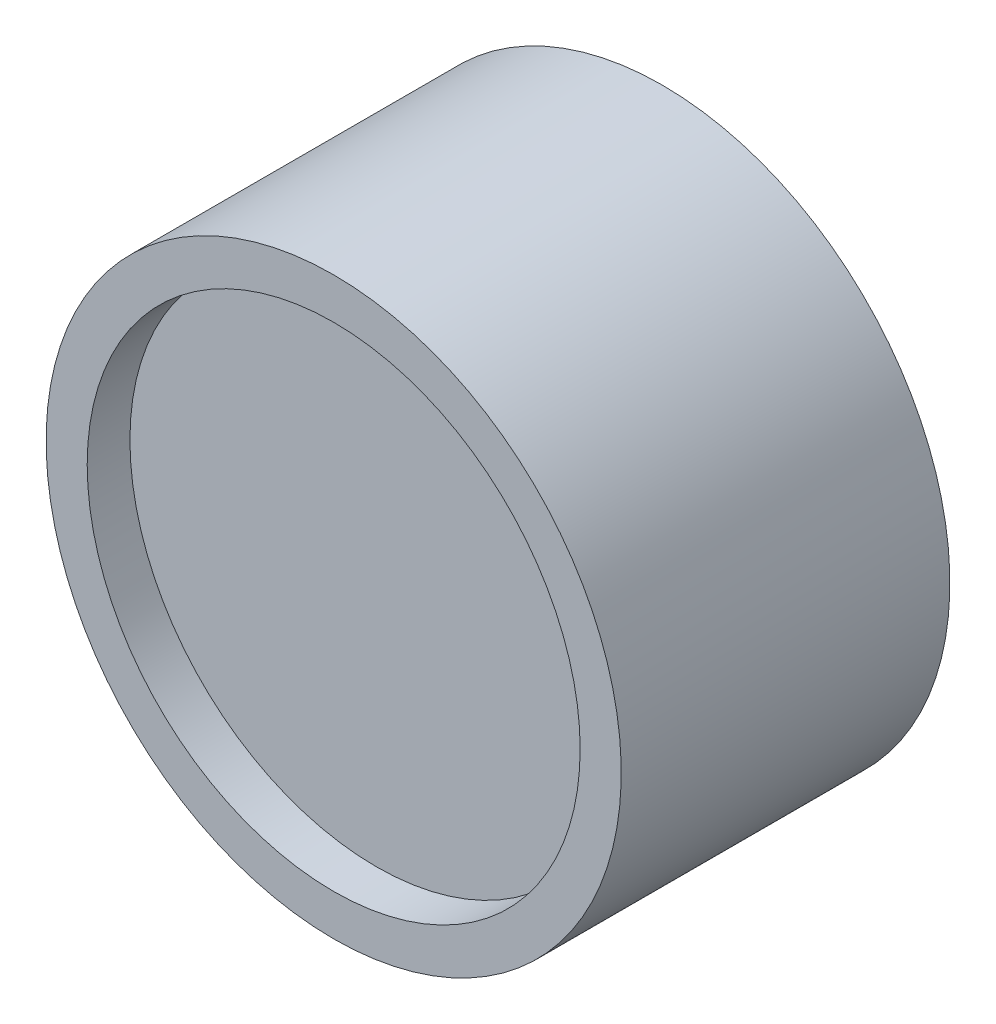
ISO-10303-21;
HEADER;
FILE_DESCRIPTION(('STEP AP214'),'2;1');
FILE_NAME('part.step','',(''),(''),'','','');
FILE_SCHEMA(('AUTOMOTIVE_DESIGN { 1 0 10303 214 1 1 1 1 }'));
ENDSEC;
DATA;
#1=APPLICATION_CONTEXT('core data for automotive mechanical design processes');
#2=APPLICATION_PROTOCOL_DEFINITION('international standard','automotive_design',2000,#1);
#3=PRODUCT_CONTEXT('',#1,'mechanical');
#4=PRODUCT('Part','Part','',(#3));
#5=PRODUCT_RELATED_PRODUCT_CATEGORY('part','',(#4));
#6=PRODUCT_DEFINITION_FORMATION('','',#4);
#7=PRODUCT_DEFINITION_CONTEXT('part definition',#1,'design');
#8=PRODUCT_DEFINITION('design','',#6,#7);
#9=PRODUCT_DEFINITION_SHAPE('','',#8);
#10=(LENGTH_UNIT() NAMED_UNIT(*) SI_UNIT(.MILLI.,.METRE.));
#11=(NAMED_UNIT(*) PLANE_ANGLE_UNIT() SI_UNIT($,.RADIAN.));
#12=(NAMED_UNIT(*) SI_UNIT($,.STERADIAN.) SOLID_ANGLE_UNIT());
#13=UNCERTAINTY_MEASURE_WITH_UNIT(LENGTH_MEASURE(1.E-05),#10,'distance_accuracy_value','');
#14=(GEOMETRIC_REPRESENTATION_CONTEXT(3) GLOBAL_UNCERTAINTY_ASSIGNED_CONTEXT((#13)) GLOBAL_UNIT_ASSIGNED_CONTEXT((#10,
#11,#12)) REPRESENTATION_CONTEXT('',''));
#15=CARTESIAN_POINT('',(0.,0.,0.));
#16=DIRECTION('',(0.,0.,1.));
#17=DIRECTION('',(1.,0.,0.));
#18=AXIS2_PLACEMENT_3D('',#15,#16,#17);
#19=CARTESIAN_POINT('',(0.,19.05,-9.39799999999999));
#20=DIRECTION('',(0.,0.,-1.));
#21=DIRECTION('',(0.,1.,0.));
#22=AXIS2_PLACEMENT_3D('',#19,#20,#21);
#23=PLANE('',#22);
#24=CARTESIAN_POINT('',(0.,0.,-9.39799999999999));
#25=DIRECTION('',(0.,0.,-1.));
#26=DIRECTION('',(0.,1.,0.));
#27=AXIS2_PLACEMENT_3D('',#24,#25,#26);
#28=CIRCLE('',#27,19.05);
#29=CARTESIAN_POINT('',(0.,19.05,-9.39799999999999));
#30=VERTEX_POINT('',#29);
#31=EDGE_CURVE('E68',#30,#30,#28,.T.);
#32=ORIENTED_EDGE('',*,*,#31,.T.);
#33=EDGE_LOOP('',(#32));
#34=FACE_BOUND('',#33,.T.);
#35=ADVANCED_FACE('F42',(#34),#23,.T.);
#36=CARTESIAN_POINT('',(0.,0.,9.39799999999999));
#37=DIRECTION('',(0.,0.,1.));
#38=DIRECTION('',(0.,-1.,0.));
#39=AXIS2_PLACEMENT_3D('',#36,#37,#38);
#40=PLANE('',#39);
#41=CARTESIAN_POINT('',(0.,0.,9.39799999999999));
#42=DIRECTION('',(0.,0.,-1.));
#43=DIRECTION('',(0.,1.,0.));
#44=AXIS2_PLACEMENT_3D('',#41,#42,#43);
#45=CIRCLE('',#44,19.05);
#46=CARTESIAN_POINT('',(0.,19.05,9.39799999999999));
#47=VERTEX_POINT('',#46);
#48=EDGE_CURVE('E54',#47,#47,#45,.T.);
#49=ORIENTED_EDGE('',*,*,#48,.F.);
#50=EDGE_LOOP('',(#49));
#51=FACE_BOUND('',#50,.T.);
#52=ADVANCED_FACE('F98',(#51),#40,.T.);
#53=CARTESIAN_POINT('',(0.,0.,0.));
#54=DIRECTION('',(0.,0.,-1.));
#55=DIRECTION('',(0.,1.,0.));
#56=AXIS2_PLACEMENT_3D('',#53,#54,#55);
#57=CYLINDRICAL_SURFACE('',#56,19.05);
#58=ORIENTED_EDGE('',*,*,#48,.T.);
#59=EDGE_LOOP('',(#58));
#60=FACE_BOUND('',#59,.T.);
#61=CARTESIAN_POINT('',(0.,0.,12.7));
#62=DIRECTION('',(0.,0.,-1.));
#63=DIRECTION('',(0.,1.,0.));
#64=AXIS2_PLACEMENT_3D('',#61,#62,#63);
#65=CIRCLE('',#64,19.05);
#66=CARTESIAN_POINT('',(0.,19.05,12.7));
#67=VERTEX_POINT('',#66);
#68=EDGE_CURVE('E87',#67,#67,#65,.T.);
#69=ORIENTED_EDGE('',*,*,#68,.F.);
#70=EDGE_LOOP('',(#69));
#71=FACE_BOUND('',#70,.T.);
#72=ADVANCED_FACE('F95',(#60,#71),#57,.F.);
#73=CARTESIAN_POINT('',(0.,19.05,12.7));
#74=DIRECTION('',(0.,0.,1.));
#75=DIRECTION('',(0.,-1.,0.));
#76=AXIS2_PLACEMENT_3D('',#73,#74,#75);
#77=PLANE('',#76);
#78=ORIENTED_EDGE('',*,*,#68,.T.);
#79=EDGE_LOOP('',(#78));
#80=FACE_BOUND('',#79,.T.);
#81=CARTESIAN_POINT('',(0.,0.,12.7));
#82=DIRECTION('',(0.,0.,-1.));
#83=DIRECTION('',(0.,1.,0.));
#84=AXIS2_PLACEMENT_3D('',#81,#82,#83);
#85=CIRCLE('',#84,22.225);
#86=CARTESIAN_POINT('',(0.,22.225,12.7));
#87=VERTEX_POINT('',#86);
#88=EDGE_CURVE('E83',#87,#87,#85,.T.);
#89=ORIENTED_EDGE('',*,*,#88,.F.);
#90=EDGE_LOOP('',(#89));
#91=FACE_BOUND('',#90,.T.);
#92=ADVANCED_FACE('F104',(#80,#91),#77,.T.);
#93=CARTESIAN_POINT('',(0.,0.,0.));
#94=DIRECTION('',(0.,0.,-1.));
#95=DIRECTION('',(0.,1.,0.));
#96=AXIS2_PLACEMENT_3D('',#93,#94,#95);
#97=CYLINDRICAL_SURFACE('',#96,22.225);
#98=CARTESIAN_POINT('',(0.,-22.225,-1.58749999999999));
#99=CARTESIAN_POINT('',(0.0890487798453091,-22.2249992505102,-1.58749609264574));
#100=CARTESIAN_POINT('',(0.178159230469294,-22.2244590967661,-1.57998219641666));
#101=CARTESIAN_POINT('',(0.35391763548917,-22.2223562476493,-1.5501167219226));
#102=CARTESIAN_POINT('',(0.440562633778052,-22.2207923746226,-1.52774805477268));
#103=CARTESIAN_POINT('',(0.608818958371993,-22.2168189279091,-1.46882052945944));
#104=CARTESIAN_POINT('',(0.690432988297742,-22.2144098131927,-1.43226937132088));
#105=CARTESIAN_POINT('',(0.846346733612157,-22.209016530152,-1.34602742457318));
#106=CARTESIAN_POINT('',(0.920648075413188,-22.2060324901352,-1.29633956679638));
#107=CARTESIAN_POINT('',(1.05998999170469,-22.1998181704503,-1.18513134139652));
#108=CARTESIAN_POINT('',(1.12501469630088,-22.1965874829863,-1.12359111017903));
#109=CARTESIAN_POINT('',(1.24382158914945,-22.1902474420535,-0.990466517408888));
#110=CARTESIAN_POINT('',(1.29760329834654,-22.1871380937593,-0.918881728082544));
#111=CARTESIAN_POINT('',(1.39244884206195,-22.1813881326419,-0.767607077207255));
#112=CARTESIAN_POINT('',(1.43349911461229,-22.1787480209346,-0.687908691951801));
#113=CARTESIAN_POINT('',(1.50162982074141,-22.1742396816116,-0.522728798321732));
#114=CARTESIAN_POINT('',(1.52871044238853,-22.1723714436044,-0.437247367819684));
#115=CARTESIAN_POINT('',(1.56808808720031,-22.1696215072539,-0.26308390438912));
#116=CARTESIAN_POINT('',(1.58041047843729,-22.1687381162285,-0.174407634237687));
#117=CARTESIAN_POINT('',(1.59000021081583,-22.1680524315257,0.00375869203487836));
#118=CARTESIAN_POINT('',(1.58726776650482,-22.1682501224418,0.093248736540714));
#119=CARTESIAN_POINT('',(1.56684640404739,-22.1697027374792,0.270329075308122));
#120=CARTESIAN_POINT('',(1.54918498269757,-22.1709557179102,0.357922558736066));
#121=CARTESIAN_POINT('',(1.49944968680589,-22.1743746638034,0.528898534779349));
#122=CARTESIAN_POINT('',(1.46737570439986,-22.1765406360985,0.612280995874039));
#123=CARTESIAN_POINT('',(1.38969470144194,-22.1815437306027,0.772556071415624));
#124=CARTESIAN_POINT('',(1.34407526138188,-22.1843814682512,0.849442646472426));
#125=CARTESIAN_POINT('',(1.24060729011334,-22.1904077269116,0.994477391924979));
#126=CARTESIAN_POINT('',(1.18275857799095,-22.1935962531125,1.06262543302315));
#127=CARTESIAN_POINT('',(1.05631956294509,-22.1999734282712,1.18840857781702));
#128=CARTESIAN_POINT('',(0.987705473474692,-22.2031620614841,1.24601977444662));
#129=CARTESIAN_POINT('',(0.841766632911346,-22.2091732949878,1.34890928276388));
#130=CARTESIAN_POINT('',(0.764441877818123,-22.2119958951105,1.39418758878778));
#131=CARTESIAN_POINT('',(0.603261759910861,-22.2169573533996,1.47112421961274));
#132=CARTESIAN_POINT('',(0.519405934472623,-22.2190961630752,1.50278157854456));
#133=CARTESIAN_POINT('',(0.347550767268368,-22.2224484329266,1.55156140764981));
#134=CARTESIAN_POINT('',(0.259551488702709,-22.2236619072117,1.56868409944569));
#135=CARTESIAN_POINT('',(0.0821147353008482,-22.225024960202,1.58787878281379));
#136=CARTESIAN_POINT('',(-0.00731914806021894,-22.2251768744895,1.58998381557813));
#137=CARTESIAN_POINT('',(-0.185268660784776,-22.2244059124829,1.57916984681902));
#138=CARTESIAN_POINT('',(-0.273784296409181,-22.2234830435218,1.5662509478017));
#139=CARTESIAN_POINT('',(-0.447291156480134,-22.2206678673679,1.52578320456595));
#140=CARTESIAN_POINT('',(-0.532285948667434,-22.2187765688341,1.49824958109011));
#141=CARTESIAN_POINT('',(-0.696448708516859,-22.2142371838267,1.42934945946167));
#142=CARTESIAN_POINT('',(-0.775616607956304,-22.211589088494,1.38798279937995));
#143=CARTESIAN_POINT('',(-0.926029235370737,-22.2058275571246,1.2925071647473));
#144=CARTESIAN_POINT('',(-0.997259969190544,-22.2027133211846,1.23837619275805));
#145=CARTESIAN_POINT('',(-1.12963525884953,-22.1963724429854,1.11894043615396));
#146=CARTESIAN_POINT('',(-1.19077968566527,-22.1931457992889,1.05363550862434));
#147=CARTESIAN_POINT('',(-1.30135918063973,-22.1869369396489,0.913562726582322));
#148=CARTESIAN_POINT('',(-1.35077276342895,-22.1839551786465,0.838777887660939));
#149=CARTESIAN_POINT('',(-1.43634079979411,-22.1785796677167,0.681953181825261));
#150=CARTESIAN_POINT('',(-1.47249535528283,-22.1761859132698,0.599913370680824));
#151=CARTESIAN_POINT('',(-1.530482072823,-22.1722596801863,0.430985059553188));
#152=CARTESIAN_POINT('',(-1.55232761141387,-22.1707263973451,0.344101170678658));
#153=CARTESIAN_POINT('',(-1.58111981510363,-22.1686918130773,0.167887330420388));
#154=CARTESIAN_POINT('',(-1.58806668223352,-22.1681904976567,0.0785574122222664));
#155=CARTESIAN_POINT('',(-1.58686226608574,-22.1682767293873,-0.0997991718701258));
#156=CARTESIAN_POINT('',(-1.57874475114552,-22.1688618412033,-0.188826068934864));
#157=CARTESIAN_POINT('',(-1.54771216948499,-22.1710498314045,-0.364249082777623));
#158=CARTESIAN_POINT('',(-1.52479707742355,-22.1726527115328,-0.450645195050108));
#159=CARTESIAN_POINT('',(-1.46482783203581,-22.1766950052155,-0.618358032604103));
#160=CARTESIAN_POINT('',(-1.4277740204065,-22.1791343985534,-0.699674880583286));
#161=CARTESIAN_POINT('',(-1.34058334626266,-22.1845748411356,-0.854938412299935));
#162=CARTESIAN_POINT('',(-1.29044676981646,-22.1875758780985,-0.928885257141381));
#163=CARTESIAN_POINT('',(-1.17838765718374,-22.1938093700963,-1.06748184562947));
#164=CARTESIAN_POINT('',(-1.11644038266147,-22.1970423018232,-1.13211156581269));
#165=CARTESIAN_POINT('',(-0.982557854313676,-22.2033710565751,-1.25007889698801));
#166=CARTESIAN_POINT('',(-0.910620171371233,-22.2064668460125,-1.30341375370421));
#167=CARTESIAN_POINT('',(-0.758694924433827,-22.2121766171986,-1.39732913263438));
#168=CARTESIAN_POINT('',(-0.678695608697478,-22.2147898793735,-1.43789066903971));
#169=CARTESIAN_POINT('',(-0.513060219064311,-22.2192310743367,-1.50495541558782));
#170=CARTESIAN_POINT('',(-0.427430829765423,-22.2210599197177,-1.53147497068465));
#171=CARTESIAN_POINT('',(-0.284403979128168,-22.2232507898786,-1.56286471313321));
#172=CARTESIAN_POINT('',(-0.227929277558056,-22.2239038006581,-1.57209086962319));
#173=CARTESIAN_POINT('',(-0.114311522402901,-22.2247786459001,-1.58440976158885));
#174=CARTESIAN_POINT('',(-0.0571684700624519,-22.2250004811653,-1.58750250848427));
#175=CARTESIAN_POINT('',(0.,-22.225,-1.58749999999999));
#176=B_SPLINE_CURVE_WITH_KNOTS('',3,(#98,#99,#100,#101,#102,#103,#104,#105,#106,#107,#108,#109,
#110,#111,#112,#113,#114,#115,#116,#117,#118,#119,#120,#121,#122,#123,#124,#125,#126,#127,#128,
#129,#130,#131,#132,#133,#134,#135,#136,#137,#138,#139,#140,#141,#142,#143,#144,#145,#146,#147,
#148,#149,#150,#151,#152,#153,#154,#155,#156,#157,#158,#159,#160,#161,#162,#163,#164,#165,#166,
#167,#168,#169,#170,#171,#172,#173,#174,#175),.UNSPECIFIED.,.T.,.F.,(4,2,2,2,2,2,2,2,2,2,2,2,2,
2,2,2,2,2,2,2,2,2,2,2,2,2,2,2,2,2,2,2,2,2,2,2,2,2,4),(0.,0.266937629617518,0.534182876696859,
0.80128323229163,1.068324047305,1.33581635740702,1.60332006282592,1.87110775144003,
2.13889183483148,2.40621495777004,2.67353427107931,2.94036229494987,3.2071923158049,
3.47426774622429,3.74134712790407,4.0090251660232,4.27670332707102,4.54440046620518,
4.81209352345949,5.07919743208778,5.34629951831528,5.61312397097009,5.87995154717376,
6.14724236669451,6.41453660511808,6.68231668736603,6.95009471133462,7.21762204897353,
7.48514575882869,7.75207051143204,8.01899572115041,8.28591448037195,8.55282740362444,
8.82030566186752,9.08784907032424,9.3557882890513,9.62341493539108,9.79478667487049,
9.96615809527446),.UNSPECIFIED.);
#177=CARTESIAN_POINT('',(0.,-22.225,-1.58749999999999));
#178=VERTEX_POINT('',#177);
#179=EDGE_CURVE('E11',#178,#178,#176,.T.);
#180=ORIENTED_EDGE('',*,*,#179,.F.);
#181=EDGE_LOOP('',(#180));
#182=FACE_BOUND('',#181,.T.);
#183=ORIENTED_EDGE('',*,*,#88,.T.);
#184=EDGE_LOOP('',(#183));
#185=FACE_BOUND('',#184,.T.);
#186=CARTESIAN_POINT('',(0.,0.,-12.7));
#187=DIRECTION('',(0.,0.,-1.));
#188=DIRECTION('',(0.,1.,0.));
#189=AXIS2_PLACEMENT_3D('',#186,#187,#188);
#190=CIRCLE('',#189,22.225);
#191=CARTESIAN_POINT('',(0.,22.225,-12.7));
#192=VERTEX_POINT('',#191);
#193=EDGE_CURVE('E79',#192,#192,#190,.T.);
#194=ORIENTED_EDGE('',*,*,#193,.F.);
#195=EDGE_LOOP('',(#194));
#196=FACE_BOUND('',#195,.T.);
#197=ADVANCED_FACE('F109',(#182,#185,#196),#97,.T.);
#198=CARTESIAN_POINT('',(0.,22.225,-12.7));
#199=DIRECTION('',(0.,0.,-1.));
#200=DIRECTION('',(0.,1.,0.));
#201=AXIS2_PLACEMENT_3D('',#198,#199,#200);
#202=PLANE('',#201);
#203=ORIENTED_EDGE('',*,*,#193,.T.);
#204=EDGE_LOOP('',(#203));
#205=FACE_BOUND('',#204,.T.);
#206=CARTESIAN_POINT('',(0.,0.,-12.7));
#207=DIRECTION('',(0.,0.,-1.));
#208=DIRECTION('',(0.,1.,0.));
#209=AXIS2_PLACEMENT_3D('',#206,#207,#208);
#210=CIRCLE('',#209,19.05);
#211=CARTESIAN_POINT('',(0.,19.05,-12.7));
#212=VERTEX_POINT('',#211);
#213=EDGE_CURVE('E73',#212,#212,#210,.T.);
#214=ORIENTED_EDGE('',*,*,#213,.F.);
#215=EDGE_LOOP('',(#214));
#216=FACE_BOUND('',#215,.T.);
#217=ADVANCED_FACE('F114',(#205,#216),#202,.T.);
#218=CARTESIAN_POINT('',(0.,0.,0.));
#219=DIRECTION('',(0.,0.,-1.));
#220=DIRECTION('',(0.,1.,0.));
#221=AXIS2_PLACEMENT_3D('',#218,#219,#220);
#222=CYLINDRICAL_SURFACE('',#221,19.05);
#223=ORIENTED_EDGE('',*,*,#213,.T.);
#224=EDGE_LOOP('',(#223));
#225=FACE_BOUND('',#224,.T.);
#226=ORIENTED_EDGE('',*,*,#31,.F.);
#227=EDGE_LOOP('',(#226));
#228=FACE_BOUND('',#227,.T.);
#229=ADVANCED_FACE('F61',(#225,#228),#222,.F.);
#230=CARTESIAN_POINT('',(0.,-6.34999999999999,0.));
#231=DIRECTION('',(0.,-1.,0.));
#232=DIRECTION('',(0.,0.,-1.));
#233=AXIS2_PLACEMENT_3D('',#230,#231,#232);
#234=CONICAL_SURFACE('',#233,1.58749999999999,1.02974425867665);
#235=CARTESIAN_POINT('',(0.,-5.39613376729374,0.));
#236=VERTEX_POINT('',#235);
#237=VERTEX_LOOP('',#236);
#238=FACE_BOUND('',#237,.T.);
#239=CARTESIAN_POINT('',(0.,-6.34999999999999,0.));
#240=DIRECTION('',(0.,-1.,0.));
#241=DIRECTION('',(0.,0.,-1.));
#242=AXIS2_PLACEMENT_3D('',#239,#240,#241);
#243=CIRCLE('',#242,1.58749999999999);
#244=CARTESIAN_POINT('',(0.,-6.34999999999999,-1.58749999999999));
#245=VERTEX_POINT('',#244);
#246=EDGE_CURVE('E65',#245,#245,#243,.T.);
#247=ORIENTED_EDGE('',*,*,#246,.T.);
#248=EDGE_LOOP('',(#247));
#249=FACE_BOUND('',#248,.T.);
#250=ADVANCED_FACE('F57',(#238,#249),#234,.F.);
#251=CARTESIAN_POINT('',(0.,-22.225,0.));
#252=DIRECTION('',(0.,-1.,0.));
#253=DIRECTION('',(0.,0.,-1.));
#254=AXIS2_PLACEMENT_3D('',#251,#252,#253);
#255=CYLINDRICAL_SURFACE('',#254,1.58749999999999);
#256=ORIENTED_EDGE('',*,*,#179,.T.);
#257=EDGE_LOOP('',(#256));
#258=FACE_BOUND('',#257,.T.);
#259=ORIENTED_EDGE('',*,*,#246,.F.);
#260=EDGE_LOOP('',(#259));
#261=FACE_BOUND('',#260,.T.);
#262=ADVANCED_FACE('F60',(#258,#261),#255,.F.);
#263=CLOSED_SHELL('',(#35,#52,#72,#92,#197,#217,#229,#250,#262));
#264=MANIFOLD_SOLID_BREP('B2',#263);
#265=ADVANCED_BREP_SHAPE_REPRESENTATION('',(#18,#264),#14);
#266=SHAPE_DEFINITION_REPRESENTATION(#9,#265);
ENDSEC;
END-ISO-10303-21;
